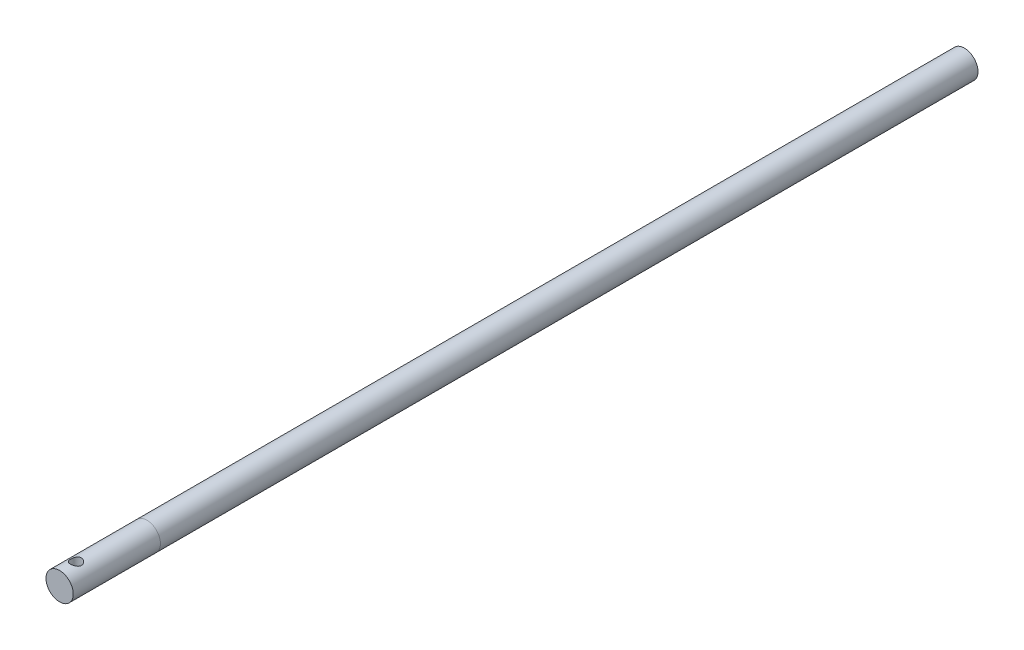
ISO-10303-21;
HEADER;
FILE_DESCRIPTION(('STEP AP214'),'2;1');
FILE_NAME('part.step','',(''),(''),'','','');
FILE_SCHEMA(('AUTOMOTIVE_DESIGN { 1 0 10303 214 1 1 1 1 }'));
ENDSEC;
DATA;
#1=APPLICATION_CONTEXT('core data for automotive mechanical design processes');
#2=APPLICATION_PROTOCOL_DEFINITION('international standard','automotive_design',2000,#1);
#3=PRODUCT_CONTEXT('',#1,'mechanical');
#4=PRODUCT('Part','Part','',(#3));
#5=PRODUCT_RELATED_PRODUCT_CATEGORY('part','',(#4));
#6=PRODUCT_DEFINITION_FORMATION('','',#4);
#7=PRODUCT_DEFINITION_CONTEXT('part definition',#1,'design');
#8=PRODUCT_DEFINITION('design','',#6,#7);
#9=PRODUCT_DEFINITION_SHAPE('','',#8);
#10=(LENGTH_UNIT() NAMED_UNIT(*) SI_UNIT(.MILLI.,.METRE.));
#11=(NAMED_UNIT(*) PLANE_ANGLE_UNIT() SI_UNIT($,.RADIAN.));
#12=(NAMED_UNIT(*) SI_UNIT($,.STERADIAN.) SOLID_ANGLE_UNIT());
#13=UNCERTAINTY_MEASURE_WITH_UNIT(LENGTH_MEASURE(1.E-05),#10,'distance_accuracy_value','');
#14=(GEOMETRIC_REPRESENTATION_CONTEXT(3) GLOBAL_UNCERTAINTY_ASSIGNED_CONTEXT((#13)) GLOBAL_UNIT_ASSIGNED_CONTEXT((#10,
#11,#12)) REPRESENTATION_CONTEXT('',''));
#15=CARTESIAN_POINT('',(0.,0.,0.));
#16=DIRECTION('',(0.,0.,1.));
#17=DIRECTION('',(1.,0.,0.));
#18=AXIS2_PLACEMENT_3D('',#15,#16,#17);
#19=CARTESIAN_POINT('',(0.,0.,166.));
#20=DIRECTION('',(0.,0.,-1.));
#21=DIRECTION('',(-1.,0.,0.));
#22=AXIS2_PLACEMENT_3D('',#19,#20,#21);
#23=CYLINDRICAL_SURFACE('',#22,2.5);
#24=CARTESIAN_POINT('',(0.,-2.5,164.));
#25=CARTESIAN_POINT('',(0.0537465027214446,-2.49999635613542,163.999995074088));
#26=CARTESIAN_POINT('',(0.107586282045335,-2.49824647153466,163.995641123956));
#27=CARTESIAN_POINT('',(0.213748240208948,-2.49141726550321,163.978376148239));
#28=CARTESIAN_POINT('',(0.266065888780625,-2.48632889349439,163.965441860457));
#29=CARTESIAN_POINT('',(0.367476961363706,-2.47337104606559,163.931561960971));
#30=CARTESIAN_POINT('',(0.416580330808486,-2.46551068182036,163.910642576892));
#31=CARTESIAN_POINT('',(0.51053598516419,-2.44778305398039,163.861490413337));
#32=CARTESIAN_POINT('',(0.5553897383755,-2.43791648729028,163.833260172541));
#33=CARTESIAN_POINT('',(0.641750503785199,-2.41665443085209,163.76888225072));
#34=CARTESIAN_POINT('',(0.68303113627511,-2.40521148464595,163.73244667188));
#35=CARTESIAN_POINT('',(0.75908750239236,-2.38230288453097,163.653299998262));
#36=CARTESIAN_POINT('',(0.793860053566759,-2.37083722226896,163.610585851394));
#37=CARTESIAN_POINT('',(0.857437283646434,-2.34861395898568,163.517785964879));
#38=CARTESIAN_POINT('',(0.885907490597737,-2.33791057982476,163.467456756988));
#39=CARTESIAN_POINT('',(0.933877359518579,-2.31916823593396,163.36223180079));
#40=CARTESIAN_POINT('',(0.95338128214292,-2.31112800622088,163.307338236076));
#41=CARTESIAN_POINT('',(0.981949411697934,-2.29913178830409,163.197143833204));
#42=CARTESIAN_POINT('',(0.991446982902826,-2.29500710177802,163.141974382212));
#43=CARTESIAN_POINT('',(1.00108648082002,-2.29082002024572,163.030682500846));
#44=CARTESIAN_POINT('',(1.00123300815661,-2.29075562761384,162.974560552687));
#45=CARTESIAN_POINT('',(0.992494683752272,-2.29455250139997,162.867121664271));
#46=CARTESIAN_POINT('',(0.984237657152572,-2.29814087519225,162.815742142795));
#47=CARTESIAN_POINT('',(0.959973440148912,-2.30838093803918,162.715170221997));
#48=CARTESIAN_POINT('',(0.943964897402313,-2.31503316160837,162.665978205945));
#49=CARTESIAN_POINT('',(0.904347366275537,-2.33079742544265,162.569991081902));
#50=CARTESIAN_POINT('',(0.880589931157668,-2.33995689640394,162.523265380473));
#51=CARTESIAN_POINT('',(0.826253230366124,-2.35969058194944,162.434292091819));
#52=CARTESIAN_POINT('',(0.795671402550437,-2.37026532728424,162.392046195299));
#53=CARTESIAN_POINT('',(0.725775299727234,-2.39263368371135,162.309795135599));
#54=CARTESIAN_POINT('',(0.685968731485341,-2.40445832488075,162.270215635277));
#55=CARTESIAN_POINT('',(0.600157213715119,-2.4272991247914,162.198157760999));
#56=CARTESIAN_POINT('',(0.554151032667231,-2.43831512222662,162.165680801295));
#57=CARTESIAN_POINT('',(0.456038826302927,-2.45857340632274,162.108191276292));
#58=CARTESIAN_POINT('',(0.403830245673244,-2.46777635047707,162.083338859401));
#59=CARTESIAN_POINT('',(0.295511882741442,-2.48307414164379,162.042916069461));
#60=CARTESIAN_POINT('',(0.239404098424834,-2.48917056731191,162.027340981221));
#61=CARTESIAN_POINT('',(0.128447943803902,-2.49728069753455,162.00677585229));
#62=CARTESIAN_POINT('',(0.0737216469927592,-2.49951472916757,162.001213772873));
#63=CARTESIAN_POINT('',(-0.0359226549039173,-2.50034239255315,161.999143449736));
#64=CARTESIAN_POINT('',(-0.090840606611971,-2.49893696791146,162.002632859226));
#65=CARTESIAN_POINT('',(-0.196716369561002,-2.49278783531876,162.018145876276));
#66=CARTESIAN_POINT('',(-0.247741245887745,-2.48819695672762,162.029778990175));
#67=CARTESIAN_POINT('',(-0.347067714030398,-2.4762972070275,162.060717854155));
#68=CARTESIAN_POINT('',(-0.395368955112431,-2.46898798678265,162.080024589834));
#69=CARTESIAN_POINT('',(-0.48953939290836,-2.45208297385406,162.12639246984));
#70=CARTESIAN_POINT('',(-0.535289011377712,-2.44242407989902,162.153672736022));
#71=CARTESIAN_POINT('',(-0.621721795623284,-2.42186682372762,162.214970161953));
#72=CARTESIAN_POINT('',(-0.662402920380566,-2.41096796555135,162.248990021461));
#73=CARTESIAN_POINT('',(-0.74036152151441,-2.38822558819056,162.325435006475));
#74=CARTESIAN_POINT('',(-0.777236966903033,-2.37636720712526,162.368266770753));
#75=CARTESIAN_POINT('',(-0.843375598706858,-2.35370836458566,162.459720041505));
#76=CARTESIAN_POINT('',(-0.872637530668759,-2.34290807763255,162.50834250017));
#77=CARTESIAN_POINT('',(-0.922903750965823,-2.32357149953854,162.610730847297));
#78=CARTESIAN_POINT('',(-0.943825297267237,-2.31505815442394,162.664541999606));
#79=CARTESIAN_POINT('',(-0.976148109852659,-2.30161836738965,162.775366825858));
#80=CARTESIAN_POINT('',(-0.987556402634662,-2.29668927847999,162.832378102906));
#81=CARTESIAN_POINT('',(-0.999857808639202,-2.29135879649963,162.943563950887));
#82=CARTESIAN_POINT('',(-1.00144854115143,-2.29065710504086,162.997647419797));
#83=CARTESIAN_POINT('',(-0.995901579638762,-2.29307418016549,163.105272428857));
#84=CARTESIAN_POINT('',(-0.98876499395689,-2.29619246162397,163.158814036951));
#85=CARTESIAN_POINT('',(-0.966535683076824,-2.3056332453951,163.261666094928));
#86=CARTESIAN_POINT('',(-0.951768746785486,-2.31182415913725,163.311060137216));
#87=CARTESIAN_POINT('',(-0.915002724245496,-2.32662000616349,163.406689314807));
#88=CARTESIAN_POINT('',(-0.893001640696893,-2.33522560603004,163.45292357345));
#89=CARTESIAN_POINT('',(-0.840936381379849,-2.35449304802246,163.543804809635));
#90=CARTESIAN_POINT('',(-0.81048266757973,-2.36524441156622,163.588209335065));
#91=CARTESIAN_POINT('',(-0.742946059635735,-2.38731902186119,163.671496658602));
#92=CARTESIAN_POINT('',(-0.705861167409049,-2.39864244024204,163.710377786064));
#93=CARTESIAN_POINT('',(-0.623252753136219,-2.42146783543697,163.784101426632));
#94=CARTESIAN_POINT('',(-0.577338000573056,-2.43293378981093,163.818518653449));
#95=CARTESIAN_POINT('',(-0.479950160142876,-2.45400203356859,163.879168521311));
#96=CARTESIAN_POINT('',(-0.428474502273608,-2.46360345546453,163.905397356076));
#97=CARTESIAN_POINT('',(-0.32236903124759,-2.47969857407931,163.948311107595));
#98=CARTESIAN_POINT('',(-0.267815809109832,-2.48624681527514,163.96516466178));
#99=CARTESIAN_POINT('',(-0.156438273140591,-2.49572153104683,163.989319560477));
#100=CARTESIAN_POINT('',(-0.0996217629294372,-2.49865949747819,163.996651218372));
#101=CARTESIAN_POINT('',(-0.028456148945453,-2.49987949752068,163.999697690489));
#102=CARTESIAN_POINT('',(-0.0142313443703733,-2.50000096484588,164.000001304315));
#103=CARTESIAN_POINT('',(0.,-2.5,164.));
#104=B_SPLINE_CURVE_WITH_KNOTS('',3,(#24,#25,#26,#27,#28,#29,#30,#31,#32,#33,#34,#35,#36,#37,
#38,#39,#40,#41,#42,#43,#44,#45,#46,#47,#48,#49,#50,#51,#52,#53,#54,#55,#56,#57,#58,#59,#60,#61,
#62,#63,#64,#65,#66,#67,#68,#69,#70,#71,#72,#73,#74,#75,#76,#77,#78,#79,#80,#81,#82,#83,#84,#85,
#86,#87,#88,#89,#90,#91,#92,#93,#94,#95,#96,#97,#98,#99,#100,#101,#102,#103),.UNSPECIFIED.,.T.,
.F.,(4,2,2,2,2,2,2,2,2,2,2,2,2,2,2,2,2,2,2,2,2,2,2,2,2,2,2,2,2,2,2,2,2,2,2,2,2,2,2,4),(0.,
0.161201493946533,0.32284181800397,0.4839557287358,0.645013767839926,0.81298690850198,
0.98104197467205,1.1565762940961,1.33202711559136,1.49952052654414,1.66693153170245,
1.82269164200687,1.97847893628024,2.13744563149405,2.29647210969089,2.46779174593274,
2.63914546419865,2.81388456581403,2.98853478056896,3.15284592264005,3.31711446785043,
3.47400227782184,3.630910244969,3.79261756699132,3.95438979749485,4.12684237312206,
4.29932334521874,4.47347522570418,4.64749836322969,4.80899836696376,4.97047786281523,
5.12557159274389,5.28070817902585,5.44472734028349,5.60879600674198,5.78350211766922,
5.95828931820269,6.12982150506662,6.30080626202174,6.34349022948398),.UNSPECIFIED.);
#105=CARTESIAN_POINT('',(0.,-2.5,164.));
#106=VERTEX_POINT('',#105);
#107=EDGE_CURVE('E11',#106,#106,#104,.T.);
#108=ORIENTED_EDGE('',*,*,#107,.T.);
#109=EDGE_LOOP('',(#108));
#110=FACE_BOUND('',#109,.T.);
#111=CARTESIAN_POINT('',(0.,2.5,164.));
#112=CARTESIAN_POINT('',(-0.0537465027214446,2.49999635613542,163.999995074088));
#113=CARTESIAN_POINT('',(-0.107586282045335,2.49824647153466,163.995641123956));
#114=CARTESIAN_POINT('',(-0.213748240208948,2.49141726550321,163.978376148239));
#115=CARTESIAN_POINT('',(-0.266065888780625,2.48632889349439,163.965441860457));
#116=CARTESIAN_POINT('',(-0.367476961363706,2.47337104606559,163.931561960971));
#117=CARTESIAN_POINT('',(-0.416580330808487,2.46551068182036,163.910642576892));
#118=CARTESIAN_POINT('',(-0.51053598516419,2.44778305398039,163.861490413337));
#119=CARTESIAN_POINT('',(-0.5553897383755,2.43791648729028,163.833260172541));
#120=CARTESIAN_POINT('',(-0.641750503785199,2.41665443085209,163.76888225072));
#121=CARTESIAN_POINT('',(-0.68303113627511,2.40521148464595,163.73244667188));
#122=CARTESIAN_POINT('',(-0.75908750239236,2.38230288453097,163.653299998262));
#123=CARTESIAN_POINT('',(-0.793860053566759,2.37083722226896,163.610585851394));
#124=CARTESIAN_POINT('',(-0.857437283646434,2.34861395898568,163.517785964879));
#125=CARTESIAN_POINT('',(-0.885907490597737,2.33791057982476,163.467456756988));
#126=CARTESIAN_POINT('',(-0.933877359518579,2.31916823593396,163.36223180079));
#127=CARTESIAN_POINT('',(-0.95338128214292,2.31112800622088,163.307338236076));
#128=CARTESIAN_POINT('',(-0.981949411697934,2.29913178830409,163.197143833204));
#129=CARTESIAN_POINT('',(-0.991446982902826,2.29500710177802,163.141974382212));
#130=CARTESIAN_POINT('',(-1.00108648082002,2.29082002024572,163.030682500846));
#131=CARTESIAN_POINT('',(-1.00123300815661,2.29075562761384,162.974560552687));
#132=CARTESIAN_POINT('',(-0.992494683752272,2.29455250139997,162.867121664271));
#133=CARTESIAN_POINT('',(-0.984237657152572,2.29814087519225,162.815742142795));
#134=CARTESIAN_POINT('',(-0.959973440148912,2.30838093803918,162.715170221997));
#135=CARTESIAN_POINT('',(-0.943964897402312,2.31503316160837,162.665978205945));
#136=CARTESIAN_POINT('',(-0.904347366275531,2.33079742544265,162.569991081902));
#137=CARTESIAN_POINT('',(-0.880589931157655,2.33995689640394,162.523265380473));
#138=CARTESIAN_POINT('',(-0.826253230366099,2.35969058194945,162.434292091819));
#139=CARTESIAN_POINT('',(-0.795671402550411,2.37026532728425,162.392046195299));
#140=CARTESIAN_POINT('',(-0.725775299727217,2.39263368371135,162.309795135599));
#141=CARTESIAN_POINT('',(-0.685968731485335,2.40445832488075,162.270215635277));
#142=CARTESIAN_POINT('',(-0.600157213715122,2.4272991247914,162.198157760999));
#143=CARTESIAN_POINT('',(-0.554151032667231,2.43831512222662,162.165680801295));
#144=CARTESIAN_POINT('',(-0.456038826302925,2.45857340632274,162.108191276292));
#145=CARTESIAN_POINT('',(-0.403830245673243,2.46777635047707,162.083338859401));
#146=CARTESIAN_POINT('',(-0.295511882741442,2.48307414164379,162.042916069461));
#147=CARTESIAN_POINT('',(-0.239404098424834,2.48917056731191,162.027340981221));
#148=CARTESIAN_POINT('',(-0.128447943803902,2.49728069753455,162.00677585229));
#149=CARTESIAN_POINT('',(-0.0737216469927583,2.49951472916757,162.001213772873));
#150=CARTESIAN_POINT('',(0.0359226549039196,2.50034239255315,161.999143449736));
#151=CARTESIAN_POINT('',(0.0908406066119741,2.49893696791146,162.002632859226));
#152=CARTESIAN_POINT('',(0.196716369561005,2.49278783531876,162.018145876276));
#153=CARTESIAN_POINT('',(0.247741245887747,2.48819695672762,162.029778990175));
#154=CARTESIAN_POINT('',(0.347067714030398,2.4762972070275,162.060717854155));
#155=CARTESIAN_POINT('',(0.395368955112431,2.46898798678265,162.080024589834));
#156=CARTESIAN_POINT('',(0.48953939290836,2.45208297385406,162.12639246984));
#157=CARTESIAN_POINT('',(0.535289011377711,2.44242407989902,162.153672736022));
#158=CARTESIAN_POINT('',(0.621721795623283,2.42186682372762,162.214970161953));
#159=CARTESIAN_POINT('',(0.662402920380566,2.41096796555135,162.248990021461));
#160=CARTESIAN_POINT('',(0.74036152151441,2.38822558819056,162.325435006475));
#161=CARTESIAN_POINT('',(0.777236966903032,2.37636720712526,162.368266770753));
#162=CARTESIAN_POINT('',(0.843375598706858,2.35370836458566,162.459720041505));
#163=CARTESIAN_POINT('',(0.872637530668759,2.34290807763255,162.50834250017));
#164=CARTESIAN_POINT('',(0.922903750965823,2.32357149953854,162.610730847297));
#165=CARTESIAN_POINT('',(0.943825297267237,2.31505815442394,162.664541999606));
#166=CARTESIAN_POINT('',(0.976148109852659,2.30161836738965,162.775366825858));
#167=CARTESIAN_POINT('',(0.987556402634662,2.29668927847999,162.832378102906));
#168=CARTESIAN_POINT('',(0.999857808639202,2.29135879649963,162.943563950887));
#169=CARTESIAN_POINT('',(1.00144854115143,2.29065710504086,162.997647419797));
#170=CARTESIAN_POINT('',(0.995901579638762,2.29307418016549,163.105272428857));
#171=CARTESIAN_POINT('',(0.98876499395689,2.29619246162397,163.158814036951));
#172=CARTESIAN_POINT('',(0.966535683076824,2.3056332453951,163.261666094928));
#173=CARTESIAN_POINT('',(0.951768746785486,2.31182415913725,163.311060137216));
#174=CARTESIAN_POINT('',(0.915002724245496,2.32662000616349,163.406689314807));
#175=CARTESIAN_POINT('',(0.893001640696893,2.33522560603004,163.45292357345));
#176=CARTESIAN_POINT('',(0.840936381379849,2.35449304802246,163.543804809635));
#177=CARTESIAN_POINT('',(0.81048266757973,2.36524441156622,163.588209335065));
#178=CARTESIAN_POINT('',(0.742946059635735,2.38731902186119,163.671496658602));
#179=CARTESIAN_POINT('',(0.705861167409049,2.39864244024204,163.710377786064));
#180=CARTESIAN_POINT('',(0.623252753136219,2.42146783543697,163.784101426632));
#181=CARTESIAN_POINT('',(0.577338000573056,2.43293378981093,163.818518653449));
#182=CARTESIAN_POINT('',(0.479950160142876,2.45400203356859,163.879168521311));
#183=CARTESIAN_POINT('',(0.428474502273608,2.46360345546453,163.905397356076));
#184=CARTESIAN_POINT('',(0.322369031247593,2.47969857407931,163.948311107595));
#185=CARTESIAN_POINT('',(0.26781580910984,2.48624681527514,163.96516466178));
#186=CARTESIAN_POINT('',(0.156438273140599,2.49572153104683,163.989319560477));
#187=CARTESIAN_POINT('',(0.0996217629294414,2.49865949747819,163.996651218372));
#188=CARTESIAN_POINT('',(0.0284561489454533,2.49987949752068,163.999697690489));
#189=CARTESIAN_POINT('',(0.0142313443703735,2.50000096484588,164.000001304315));
#190=CARTESIAN_POINT('',(0.,2.5,164.));
#191=B_SPLINE_CURVE_WITH_KNOTS('',3,(#111,#112,#113,#114,#115,#116,#117,#118,#119,#120,#121,
#122,#123,#124,#125,#126,#127,#128,#129,#130,#131,#132,#133,#134,#135,#136,#137,#138,#139,#140,
#141,#142,#143,#144,#145,#146,#147,#148,#149,#150,#151,#152,#153,#154,#155,#156,#157,#158,#159,
#160,#161,#162,#163,#164,#165,#166,#167,#168,#169,#170,#171,#172,#173,#174,#175,#176,#177,#178,
#179,#180,#181,#182,#183,#184,#185,#186,#187,#188,#189,#190),.UNSPECIFIED.,.T.,.F.,(4,2,2,2,2,2,
2,2,2,2,2,2,2,2,2,2,2,2,2,2,2,2,2,2,2,2,2,2,2,2,2,2,2,2,2,2,2,2,2,4),(0.,0.161201493946533,
0.32284181800397,0.4839557287358,0.645013767839926,0.81298690850198,0.98104197467205,
1.1565762940961,1.33202711559136,1.49952052654414,1.66693153170245,1.82269164200687,
1.97847893628024,2.13744563149411,2.29647210969093,2.46779174593274,2.63914546419865,
2.81388456581403,2.98853478056896,3.15284592264005,3.31711446785043,3.47400227782185,
3.630910244969,3.79261756699132,3.95438979749485,4.12684237312206,4.29932334521874,
4.47347522570418,4.64749836322969,4.80899836696376,4.97047786281523,5.12557159274389,
5.28070817902585,5.44472734028349,5.60879600674198,5.78350211766922,5.95828931820269,
6.12982150506661,6.30080626202174,6.34349022948399),.UNSPECIFIED.);
#192=CARTESIAN_POINT('',(0.,2.5,164.));
#193=VERTEX_POINT('',#192);
#194=EDGE_CURVE('E58',#193,#193,#191,.T.);
#195=ORIENTED_EDGE('',*,*,#194,.T.);
#196=EDGE_LOOP('',(#195));
#197=FACE_BOUND('',#196,.T.);
#198=CARTESIAN_POINT('',(0.,0.,166.));
#199=DIRECTION('',(0.,0.,1.));
#200=DIRECTION('',(1.,0.,0.));
#201=AXIS2_PLACEMENT_3D('',#198,#199,#200);
#202=CIRCLE('',#201,2.5);
#203=CARTESIAN_POINT('',(2.5,0.,166.));
#204=VERTEX_POINT('',#203);
#205=EDGE_CURVE('E62',#204,#204,#202,.T.);
#206=ORIENTED_EDGE('',*,*,#205,.F.);
#207=EDGE_LOOP('',(#206));
#208=FACE_BOUND('',#207,.T.);
#209=CARTESIAN_POINT('',(0.,0.,150.));
#210=DIRECTION('',(0.,0.,1.));
#211=DIRECTION('',(1.,0.,0.));
#212=AXIS2_PLACEMENT_3D('',#209,#210,#211);
#213=CIRCLE('',#212,2.5);
#214=CARTESIAN_POINT('',(2.5,0.,150.));
#215=VERTEX_POINT('',#214);
#216=EDGE_CURVE('E66',#215,#215,#213,.T.);
#217=ORIENTED_EDGE('',*,*,#216,.T.);
#218=EDGE_LOOP('',(#217));
#219=FACE_BOUND('',#218,.T.);
#220=ADVANCED_FACE('F47',(#110,#197,#208,#219),#23,.T.);
#221=CARTESIAN_POINT('',(0.,0.,166.));
#222=DIRECTION('',(0.,0.,1.));
#223=DIRECTION('',(1.,0.,0.));
#224=AXIS2_PLACEMENT_3D('',#221,#222,#223);
#225=PLANE('',#224);
#226=ORIENTED_EDGE('',*,*,#205,.T.);
#227=EDGE_LOOP('',(#226));
#228=FACE_BOUND('',#227,.T.);
#229=ADVANCED_FACE('F78',(#228),#225,.T.);
#230=CARTESIAN_POINT('',(0.,0.,150.));
#231=DIRECTION('',(0.,0.,1.));
#232=DIRECTION('',(1.,0.,0.));
#233=AXIS2_PLACEMENT_3D('',#230,#231,#232);
#234=PLANE('',#233);
#235=ORIENTED_EDGE('',*,*,#216,.F.);
#236=EDGE_LOOP('',(#235));
#237=FACE_BOUND('',#236,.T.);
#238=ADVANCED_FACE('F76',(#237),#234,.F.);
#239=CARTESIAN_POINT('',(0.,-2.5,163.));
#240=DIRECTION('',(0.,1.,0.));
#241=DIRECTION('',(0.,0.,1.));
#242=AXIS2_PLACEMENT_3D('',#239,#240,#241);
#243=CYLINDRICAL_SURFACE('',#242,1.);
#244=ORIENTED_EDGE('',*,*,#194,.F.);
#245=EDGE_LOOP('',(#244));
#246=FACE_BOUND('',#245,.T.);
#247=ORIENTED_EDGE('',*,*,#107,.F.);
#248=EDGE_LOOP('',(#247));
#249=FACE_BOUND('',#248,.T.);
#250=ADVANCED_FACE('F72',(#246,#249),#243,.F.);
#251=CLOSED_SHELL('',(#220,#229,#238,#250));
#252=MANIFOLD_SOLID_BREP('B2',#251);
#253=CARTESIAN_POINT('',(0.,0.,150.));
#254=DIRECTION('',(0.,0.,-1.));
#255=DIRECTION('',(-1.,0.,0.));
#256=AXIS2_PLACEMENT_3D('',#253,#254,#255);
#257=CYLINDRICAL_SURFACE('',#256,2.5);
#258=CARTESIAN_POINT('',(0.,0.,150.));
#259=DIRECTION('',(0.,0.,1.));
#260=DIRECTION('',(1.,0.,0.));
#261=AXIS2_PLACEMENT_3D('',#258,#259,#260);
#262=CIRCLE('',#261,2.5);
#263=CARTESIAN_POINT('',(2.5,0.,150.));
#264=VERTEX_POINT('',#263);
#265=EDGE_CURVE('E46',#264,#264,#262,.T.);
#266=ORIENTED_EDGE('',*,*,#265,.F.);
#267=EDGE_LOOP('',(#266));
#268=FACE_BOUND('',#267,.T.);
#269=CARTESIAN_POINT('',(0.,0.,0.));
#270=DIRECTION('',(0.,0.,1.));
#271=DIRECTION('',(1.,0.,0.));
#272=AXIS2_PLACEMENT_3D('',#269,#270,#271);
#273=CIRCLE('',#272,2.5);
#274=CARTESIAN_POINT('',(2.5,0.,0.));
#275=VERTEX_POINT('',#274);
#276=EDGE_CURVE('E126',#275,#275,#273,.T.);
#277=ORIENTED_EDGE('',*,*,#276,.T.);
#278=EDGE_LOOP('',(#277));
#279=FACE_BOUND('',#278,.T.);
#280=ADVANCED_FACE('F123',(#268,#279),#257,.T.);
#281=CARTESIAN_POINT('',(0.,0.,150.));
#282=DIRECTION('',(0.,0.,1.));
#283=DIRECTION('',(1.,0.,0.));
#284=AXIS2_PLACEMENT_3D('',#281,#282,#283);
#285=PLANE('',#284);
#286=ORIENTED_EDGE('',*,*,#265,.T.);
#287=EDGE_LOOP('',(#286));
#288=FACE_BOUND('',#287,.T.);
#289=ADVANCED_FACE('F138',(#288),#285,.T.);
#290=CARTESIAN_POINT('',(0.,0.,0.));
#291=DIRECTION('',(0.,0.,1.));
#292=DIRECTION('',(1.,0.,0.));
#293=AXIS2_PLACEMENT_3D('',#290,#291,#292);
#294=PLANE('',#293);
#295=ORIENTED_EDGE('',*,*,#276,.F.);
#296=EDGE_LOOP('',(#295));
#297=FACE_BOUND('',#296,.T.);
#298=ADVANCED_FACE('F136',(#297),#294,.F.);
#299=CLOSED_SHELL('',(#280,#289,#298));
#300=MANIFOLD_SOLID_BREP('B6',#299);
#301=ADVANCED_BREP_SHAPE_REPRESENTATION('',(#18,#252,#300),#14);
#302=SHAPE_DEFINITION_REPRESENTATION(#9,#301);
ENDSEC;
END-ISO-10303-21;
